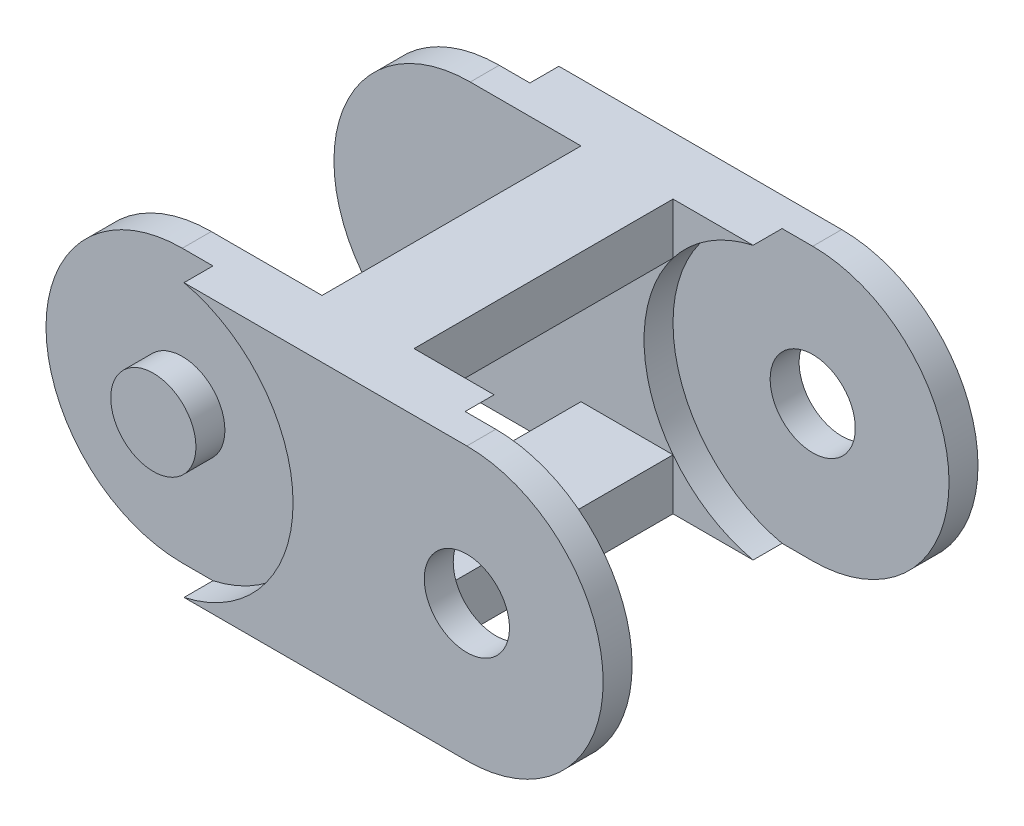
ISO-10303-21;
HEADER;
FILE_DESCRIPTION(('STEP AP214'),'2;1');
FILE_NAME('part.step','',(''),(''),'','','');
FILE_SCHEMA(('AUTOMOTIVE_DESIGN { 1 0 10303 214 1 1 1 1 }'));
ENDSEC;
DATA;
#1=APPLICATION_CONTEXT('core data for automotive mechanical design processes');
#2=APPLICATION_PROTOCOL_DEFINITION('international standard','automotive_design',2000,#1);
#3=PRODUCT_CONTEXT('',#1,'mechanical');
#4=PRODUCT('Part','Part','',(#3));
#5=PRODUCT_RELATED_PRODUCT_CATEGORY('part','',(#4));
#6=PRODUCT_DEFINITION_FORMATION('','',#4);
#7=PRODUCT_DEFINITION_CONTEXT('part definition',#1,'design');
#8=PRODUCT_DEFINITION('design','',#6,#7);
#9=PRODUCT_DEFINITION_SHAPE('','',#8);
#10=(LENGTH_UNIT() NAMED_UNIT(*) SI_UNIT(.MILLI.,.METRE.));
#11=(NAMED_UNIT(*) PLANE_ANGLE_UNIT() SI_UNIT($,.RADIAN.));
#12=(NAMED_UNIT(*) SI_UNIT($,.STERADIAN.) SOLID_ANGLE_UNIT());
#13=UNCERTAINTY_MEASURE_WITH_UNIT(LENGTH_MEASURE(1.E-05),#10,'distance_accuracy_value','');
#14=(GEOMETRIC_REPRESENTATION_CONTEXT(3) GLOBAL_UNCERTAINTY_ASSIGNED_CONTEXT((#13)) GLOBAL_UNIT_ASSIGNED_CONTEXT((#10,
#11,#12)) REPRESENTATION_CONTEXT('',''));
#15=CARTESIAN_POINT('',(0.,0.,0.));
#16=DIRECTION('',(0.,0.,1.));
#17=DIRECTION('',(1.,0.,0.));
#18=AXIS2_PLACEMENT_3D('',#15,#16,#17);
#19=CARTESIAN_POINT('',(-23.,0.,0.));
#20=DIRECTION('',(0.,0.,1.));
#21=DIRECTION('',(1.,0.,0.));
#22=AXIS2_PLACEMENT_3D('',#19,#20,#21);
#23=PLANE('',#22);
#24=DIRECTION('',(-1.,0.,0.));
#25=VECTOR('',#24,1.);
#26=CARTESIAN_POINT('',(6.75192319072807,-12.5,0.));
#27=LINE('',#26,#25);
#28=CARTESIAN_POINT('',(6.75192319072807,-12.5,0.));
#29=VERTEX_POINT('',#28);
#30=CARTESIAN_POINT('',(-6.75192319072807,-12.5,0.));
#31=VERTEX_POINT('',#30);
#32=EDGE_CURVE('E242',#29,#31,#27,.T.);
#33=ORIENTED_EDGE('',*,*,#32,.T.);
#34=DIRECTION('',(0.,-1.,0.));
#35=VECTOR('',#34,1.);
#36=CARTESIAN_POINT('',(-6.75192319072807,-12.5,0.));
#37=LINE('',#36,#35);
#38=CARTESIAN_POINT('',(-6.75192319072807,-20.,0.));
#39=VERTEX_POINT('',#38);
#40=EDGE_CURVE('E216',#31,#39,#37,.T.);
#41=ORIENTED_EDGE('',*,*,#40,.T.);
#42=DIRECTION('',(1.,0.,0.));
#43=VECTOR('',#42,1.);
#44=CARTESIAN_POINT('',(-23.,-20.,0.));
#45=LINE('',#44,#43);
#46=CARTESIAN_POINT('',(-23.,-20.,0.));
#47=VERTEX_POINT('',#46);
#48=EDGE_CURVE('E314',#47,#39,#45,.T.);
#49=ORIENTED_EDGE('',*,*,#48,.F.);
#50=CARTESIAN_POINT('',(-23.,0.,0.));
#51=DIRECTION('',(0.,0.,1.));
#52=DIRECTION('',(1.,0.,0.));
#53=AXIS2_PLACEMENT_3D('',#50,#51,#52);
#54=CIRCLE('',#53,20.);
#55=CARTESIAN_POINT('',(-23.,20.,0.));
#56=VERTEX_POINT('',#55);
#57=EDGE_CURVE('E301',#56,#47,#54,.T.);
#58=ORIENTED_EDGE('',*,*,#57,.F.);
#59=DIRECTION('',(-1.,0.,0.));
#60=VECTOR('',#59,1.);
#61=CARTESIAN_POINT('',(-23.,20.,0.));
#62=LINE('',#61,#60);
#63=CARTESIAN_POINT('',(-6.75192319072807,20.,0.));
#64=VERTEX_POINT('',#63);
#65=EDGE_CURVE('E317',#64,#56,#62,.T.);
#66=ORIENTED_EDGE('',*,*,#65,.F.);
#67=DIRECTION('',(0.,1.,0.));
#68=VECTOR('',#67,1.);
#69=CARTESIAN_POINT('',(-6.75192319072807,12.5,0.));
#70=LINE('',#69,#68);
#71=CARTESIAN_POINT('',(-6.75192319072807,12.5,0.));
#72=VERTEX_POINT('',#71);
#73=EDGE_CURVE('E40',#72,#64,#70,.T.);
#74=ORIENTED_EDGE('',*,*,#73,.F.);
#75=DIRECTION('',(-1.,0.,0.));
#76=VECTOR('',#75,1.);
#77=CARTESIAN_POINT('',(6.75192319072807,12.5,0.));
#78=LINE('',#77,#76);
#79=CARTESIAN_POINT('',(6.75192319072807,12.5,0.));
#80=VERTEX_POINT('',#79);
#81=EDGE_CURVE('E252',#80,#72,#78,.T.);
#82=ORIENTED_EDGE('',*,*,#81,.F.);
#83=CARTESIAN_POINT('',(23.,0.,0.));
#84=DIRECTION('',(0.,0.,1.));
#85=DIRECTION('',(1.,0.,0.));
#86=AXIS2_PLACEMENT_3D('',#83,#84,#85);
#87=CIRCLE('',#86,20.5);
#88=EDGE_CURVE('E332',#80,#29,#87,.T.);
#89=ORIENTED_EDGE('',*,*,#88,.T.);
#90=EDGE_LOOP('',(#33,#41,#49,#58,#66,#74,#82,#89));
#91=FACE_BOUND('',#90,.T.);
#92=ADVANCED_FACE('F36',(#91),#23,.F.);
#93=CARTESIAN_POINT('',(6.75192319072807,-20.,0.));
#94=VERTEX_POINT('',#93);
#95=CARTESIAN_POINT('',(18.5,-20.,0.));
#96=VERTEX_POINT('',#95);
#97=EDGE_CURVE('E313',#94,#96,#45,.T.);
#98=ORIENTED_EDGE('',*,*,#97,.F.);
#99=DIRECTION('',(0.,1.,0.));
#100=VECTOR('',#99,1.);
#101=CARTESIAN_POINT('',(6.75192319072807,-12.5,0.));
#102=LINE('',#101,#100);
#103=EDGE_CURVE('E54',#94,#29,#102,.T.);
#104=ORIENTED_EDGE('',*,*,#103,.T.);
#105=EDGE_CURVE('E333',#29,#96,#87,.T.);
#106=ORIENTED_EDGE('',*,*,#105,.T.);
#107=EDGE_LOOP('',(#98,#104,#106));
#108=FACE_BOUND('',#107,.T.);
#109=ADVANCED_FACE('F495',(#108),#23,.F.);
#110=DIRECTION('',(0.,-1.,0.));
#111=VECTOR('',#110,1.);
#112=CARTESIAN_POINT('',(6.75192319072807,12.5,0.));
#113=LINE('',#112,#111);
#114=CARTESIAN_POINT('',(6.75192319072807,20.,0.));
#115=VERTEX_POINT('',#114);
#116=EDGE_CURVE('E255',#115,#80,#113,.T.);
#117=ORIENTED_EDGE('',*,*,#116,.F.);
#118=CARTESIAN_POINT('',(18.5,20.,0.));
#119=VERTEX_POINT('',#118);
#120=EDGE_CURVE('E305',#119,#115,#62,.T.);
#121=ORIENTED_EDGE('',*,*,#120,.F.);
#122=EDGE_CURVE('E330',#119,#80,#87,.T.);
#123=ORIENTED_EDGE('',*,*,#122,.T.);
#124=EDGE_LOOP('',(#117,#121,#123));
#125=FACE_BOUND('',#124,.T.);
#126=ADVANCED_FACE('F386',(#125),#23,.F.);
#127=CARTESIAN_POINT('',(-23.,0.,8.5));
#128=DIRECTION('',(0.,0.,-1.));
#129=DIRECTION('',(-1.,0.,0.));
#130=AXIS2_PLACEMENT_3D('',#127,#128,#129);
#131=CYLINDRICAL_SURFACE('',#130,20.);
#132=CARTESIAN_POINT('',(-23.,0.,4.25));
#133=DIRECTION('',(0.,0.,1.));
#134=DIRECTION('',(1.,0.,0.));
#135=AXIS2_PLACEMENT_3D('',#132,#133,#134);
#136=CIRCLE('',#135,20.);
#137=CARTESIAN_POINT('',(-23.,20.,4.25));
#138=VERTEX_POINT('',#137);
#139=CARTESIAN_POINT('',(-23.,-20.,4.25));
#140=VERTEX_POINT('',#139);
#141=EDGE_CURVE('E284',#138,#140,#136,.T.);
#142=ORIENTED_EDGE('',*,*,#141,.F.);
#143=DIRECTION('',(0.,0.,-1.));
#144=VECTOR('',#143,1.);
#145=CARTESIAN_POINT('',(-23.,20.,8.5));
#146=LINE('',#145,#144);
#147=EDGE_CURVE('E310',#138,#56,#146,.T.);
#148=ORIENTED_EDGE('',*,*,#147,.T.);
#149=ORIENTED_EDGE('',*,*,#57,.T.);
#150=DIRECTION('',(0.,0.,-1.));
#151=VECTOR('',#150,1.);
#152=CARTESIAN_POINT('',(-23.,-20.,8.5));
#153=LINE('',#152,#151);
#154=EDGE_CURVE('E334',#140,#47,#153,.T.);
#155=ORIENTED_EDGE('',*,*,#154,.F.);
#156=EDGE_LOOP('',(#142,#148,#149,#155));
#157=FACE_BOUND('',#156,.T.);
#158=ADVANCED_FACE('F38',(#157),#131,.T.);
#159=CARTESIAN_POINT('',(23.,0.,8.5));
#160=DIRECTION('',(0.,0.,-1.));
#161=DIRECTION('',(-1.,0.,0.));
#162=AXIS2_PLACEMENT_3D('',#159,#160,#161);
#163=CYLINDRICAL_SURFACE('',#162,20.);
#164=CARTESIAN_POINT('',(23.,0.,4.25));
#165=DIRECTION('',(0.,0.,-1.));
#166=DIRECTION('',(-1.,0.,0.));
#167=AXIS2_PLACEMENT_3D('',#164,#165,#166);
#168=CIRCLE('',#167,20.);
#169=CARTESIAN_POINT('',(23.,20.,4.25));
#170=VERTEX_POINT('',#169);
#171=CARTESIAN_POINT('',(23.,-20.,4.25));
#172=VERTEX_POINT('',#171);
#173=EDGE_CURVE('E297',#170,#172,#168,.T.);
#174=ORIENTED_EDGE('',*,*,#173,.F.);
#175=DIRECTION('',(0.,0.,-1.));
#176=VECTOR('',#175,1.);
#177=CARTESIAN_POINT('',(23.,20.,8.5));
#178=LINE('',#177,#176);
#179=CARTESIAN_POINT('',(23.,20.,8.5));
#180=VERTEX_POINT('',#179);
#181=EDGE_CURVE('E338',#180,#170,#178,.T.);
#182=ORIENTED_EDGE('',*,*,#181,.F.);
#183=CARTESIAN_POINT('',(23.,0.,8.5));
#184=DIRECTION('',(0.,0.,1.));
#185=DIRECTION('',(1.,0.,0.));
#186=AXIS2_PLACEMENT_3D('',#183,#184,#185);
#187=CIRCLE('',#186,20.);
#188=CARTESIAN_POINT('',(23.,-20.,8.5));
#189=VERTEX_POINT('',#188);
#190=EDGE_CURVE('E304',#189,#180,#187,.T.);
#191=ORIENTED_EDGE('',*,*,#190,.F.);
#192=DIRECTION('',(0.,0.,-1.));
#193=VECTOR('',#192,1.);
#194=CARTESIAN_POINT('',(23.,-20.,8.5));
#195=LINE('',#194,#193);
#196=EDGE_CURVE('E336',#189,#172,#195,.T.);
#197=ORIENTED_EDGE('',*,*,#196,.T.);
#198=EDGE_LOOP('',(#174,#182,#191,#197));
#199=FACE_BOUND('',#198,.T.);
#200=ADVANCED_FACE('F370',(#199),#163,.T.);
#201=CARTESIAN_POINT('',(-23.,-20.,8.5));
#202=DIRECTION('',(0.,1.,0.));
#203=DIRECTION('',(-1.,0.,0.));
#204=AXIS2_PLACEMENT_3D('',#201,#202,#203);
#205=PLANE('',#204);
#206=DIRECTION('',(0.,0.,1.));
#207=VECTOR('',#206,1.);
#208=CARTESIAN_POINT('',(6.75192319072807,-20.,-38.));
#209=LINE('',#208,#207);
#210=CARTESIAN_POINT('',(6.75192319072807,-20.,-38.));
#211=VERTEX_POINT('',#210);
#212=EDGE_CURVE('E248',#211,#94,#209,.T.);
#213=ORIENTED_EDGE('',*,*,#212,.T.);
#214=ORIENTED_EDGE('',*,*,#97,.T.);
#215=DIRECTION('',(0.,0.,-1.));
#216=VECTOR('',#215,1.);
#217=CARTESIAN_POINT('',(18.5,-20.,4.25));
#218=LINE('',#217,#216);
#219=CARTESIAN_POINT('',(18.5,-20.,4.25));
#220=VERTEX_POINT('',#219);
#221=EDGE_CURVE('E294',#96,#220,#218,.F.);
#222=ORIENTED_EDGE('',*,*,#221,.T.);
#223=DIRECTION('',(-1.,0.,0.));
#224=VECTOR('',#223,1.);
#225=CARTESIAN_POINT('',(-23.,-20.,4.25));
#226=LINE('',#225,#224);
#227=EDGE_CURVE('E299',#172,#220,#226,.T.);
#228=ORIENTED_EDGE('',*,*,#227,.F.);
#229=ORIENTED_EDGE('',*,*,#196,.F.);
#230=DIRECTION('',(1.,0.,0.));
#231=VECTOR('',#230,1.);
#232=CARTESIAN_POINT('',(-23.,-20.,8.5));
#233=LINE('',#232,#231);
#234=CARTESIAN_POINT('',(-18.5,-20.,8.5));
#235=VERTEX_POINT('',#234);
#236=EDGE_CURVE('E302',#235,#189,#233,.T.);
#237=ORIENTED_EDGE('',*,*,#236,.F.);
#238=DIRECTION('',(0.,0.,1.));
#239=VECTOR('',#238,1.);
#240=CARTESIAN_POINT('',(-18.5,-20.,4.25));
#241=LINE('',#240,#239);
#242=CARTESIAN_POINT('',(-18.5,-20.,4.25));
#243=VERTEX_POINT('',#242);
#244=EDGE_CURVE('E281',#235,#243,#241,.F.);
#245=ORIENTED_EDGE('',*,*,#244,.T.);
#246=DIRECTION('',(1.,0.,0.));
#247=VECTOR('',#246,1.);
#248=CARTESIAN_POINT('',(-23.,-20.,4.25));
#249=LINE('',#248,#247);
#250=EDGE_CURVE('E286',#140,#243,#249,.T.);
#251=ORIENTED_EDGE('',*,*,#250,.F.);
#252=ORIENTED_EDGE('',*,*,#154,.T.);
#253=ORIENTED_EDGE('',*,*,#48,.T.);
#254=DIRECTION('',(0.,0.,1.));
#255=VECTOR('',#254,1.);
#256=CARTESIAN_POINT('',(-6.75192319072807,-20.,-38.));
#257=LINE('',#256,#255);
#258=CARTESIAN_POINT('',(-6.75192319072807,-20.,-38.));
#259=VERTEX_POINT('',#258);
#260=EDGE_CURVE('E246',#259,#39,#257,.T.);
#261=ORIENTED_EDGE('',*,*,#260,.F.);
#262=DIRECTION('',(1.,0.,0.));
#263=VECTOR('',#262,1.);
#264=CARTESIAN_POINT('',(-23.,-20.,-38.));
#265=LINE('',#264,#263);
#266=CARTESIAN_POINT('',(-23.,-20.,-38.));
#267=VERTEX_POINT('',#266);
#268=EDGE_CURVE('E208',#267,#259,#265,.T.);
#269=ORIENTED_EDGE('',*,*,#268,.F.);
#270=DIRECTION('',(0.,0.,1.));
#271=VECTOR('',#270,1.);
#272=CARTESIAN_POINT('',(-23.,-20.,-46.5));
#273=LINE('',#272,#271);
#274=CARTESIAN_POINT('',(-23.,-20.,-42.25));
#275=VERTEX_POINT('',#274);
#276=EDGE_CURVE('E435',#275,#267,#273,.T.);
#277=ORIENTED_EDGE('',*,*,#276,.F.);
#278=DIRECTION('',(1.,0.,0.));
#279=VECTOR('',#278,1.);
#280=CARTESIAN_POINT('',(-23.,-20.,-42.25));
#281=LINE('',#280,#279);
#282=CARTESIAN_POINT('',(-18.5,-20.,-42.25));
#283=VERTEX_POINT('',#282);
#284=EDGE_CURVE('E459',#275,#283,#281,.T.);
#285=ORIENTED_EDGE('',*,*,#284,.T.);
#286=DIRECTION('',(0.,0.,-1.));
#287=VECTOR('',#286,1.);
#288=CARTESIAN_POINT('',(-18.5,-20.,-42.25));
#289=LINE('',#288,#287);
#290=CARTESIAN_POINT('',(-18.5,-20.,-46.5));
#291=VERTEX_POINT('',#290);
#292=EDGE_CURVE('E461',#291,#283,#289,.F.);
#293=ORIENTED_EDGE('',*,*,#292,.F.);
#294=DIRECTION('',(1.,0.,0.));
#295=VECTOR('',#294,1.);
#296=CARTESIAN_POINT('',(-23.,-20.,-46.5));
#297=LINE('',#296,#295);
#298=CARTESIAN_POINT('',(23.,-20.,-46.5));
#299=VERTEX_POINT('',#298);
#300=EDGE_CURVE('E481',#291,#299,#297,.T.);
#301=ORIENTED_EDGE('',*,*,#300,.T.);
#302=DIRECTION('',(0.,0.,1.));
#303=VECTOR('',#302,1.);
#304=CARTESIAN_POINT('',(23.,-20.,-46.5));
#305=LINE('',#304,#303);
#306=CARTESIAN_POINT('',(23.,-20.,-42.25));
#307=VERTEX_POINT('',#306);
#308=EDGE_CURVE('E432',#299,#307,#305,.T.);
#309=ORIENTED_EDGE('',*,*,#308,.T.);
#310=DIRECTION('',(-1.,0.,0.));
#311=VECTOR('',#310,1.);
#312=CARTESIAN_POINT('',(-23.,-20.,-42.25));
#313=LINE('',#312,#311);
#314=CARTESIAN_POINT('',(18.5,-20.,-42.25));
#315=VERTEX_POINT('',#314);
#316=EDGE_CURVE('E478',#307,#315,#313,.T.);
#317=ORIENTED_EDGE('',*,*,#316,.T.);
#318=DIRECTION('',(0.,0.,1.));
#319=VECTOR('',#318,1.);
#320=CARTESIAN_POINT('',(18.5,-20.,-42.25));
#321=LINE('',#320,#319);
#322=CARTESIAN_POINT('',(18.5,-20.,-38.));
#323=VERTEX_POINT('',#322);
#324=EDGE_CURVE('E472',#323,#315,#321,.F.);
#325=ORIENTED_EDGE('',*,*,#324,.F.);
#326=EDGE_CURVE('E486',#211,#323,#265,.T.);
#327=ORIENTED_EDGE('',*,*,#326,.F.);
#328=EDGE_LOOP('',(#213,#214,#222,#228,#229,#237,#245,#251,#252,#253,#261,#269,#277,#285,#293,
#301,#309,#317,#325,#327));
#329=FACE_BOUND('',#328,.T.);
#330=ADVANCED_FACE('F354',(#329),#205,.F.);
#331=CARTESIAN_POINT('',(-23.,20.,8.5));
#332=DIRECTION('',(0.,-1.,0.));
#333=DIRECTION('',(1.,0.,0.));
#334=AXIS2_PLACEMENT_3D('',#331,#332,#333);
#335=PLANE('',#334);
#336=DIRECTION('',(0.,0.,1.));
#337=VECTOR('',#336,1.);
#338=CARTESIAN_POINT('',(-6.75192319072807,20.,-38.));
#339=LINE('',#338,#337);
#340=CARTESIAN_POINT('',(-6.75192319072807,20.,-38.));
#341=VERTEX_POINT('',#340);
#342=EDGE_CURVE('E266',#341,#64,#339,.T.);
#343=ORIENTED_EDGE('',*,*,#342,.T.);
#344=ORIENTED_EDGE('',*,*,#65,.T.);
#345=ORIENTED_EDGE('',*,*,#147,.F.);
#346=DIRECTION('',(-1.,0.,0.));
#347=VECTOR('',#346,1.);
#348=CARTESIAN_POINT('',(-23.,20.,4.25));
#349=LINE('',#348,#347);
#350=CARTESIAN_POINT('',(-18.5,20.,4.25));
#351=VERTEX_POINT('',#350);
#352=EDGE_CURVE('E11',#351,#138,#349,.T.);
#353=ORIENTED_EDGE('',*,*,#352,.F.);
#354=DIRECTION('',(0.,0.,1.));
#355=VECTOR('',#354,1.);
#356=CARTESIAN_POINT('',(-18.5,20.,4.25));
#357=LINE('',#356,#355);
#358=CARTESIAN_POINT('',(-18.5,20.,8.5));
#359=VERTEX_POINT('',#358);
#360=EDGE_CURVE('E278',#351,#359,#357,.T.);
#361=ORIENTED_EDGE('',*,*,#360,.T.);
#362=DIRECTION('',(-1.,0.,0.));
#363=VECTOR('',#362,1.);
#364=CARTESIAN_POINT('',(-23.,20.,8.5));
#365=LINE('',#364,#363);
#366=EDGE_CURVE('E307',#180,#359,#365,.T.);
#367=ORIENTED_EDGE('',*,*,#366,.F.);
#368=ORIENTED_EDGE('',*,*,#181,.T.);
#369=DIRECTION('',(1.,0.,0.));
#370=VECTOR('',#369,1.);
#371=CARTESIAN_POINT('',(-23.,20.,4.25));
#372=LINE('',#371,#370);
#373=CARTESIAN_POINT('',(18.5,20.,4.25));
#374=VERTEX_POINT('',#373);
#375=EDGE_CURVE('E328',#374,#170,#372,.T.);
#376=ORIENTED_EDGE('',*,*,#375,.F.);
#377=DIRECTION('',(0.,0.,-1.));
#378=VECTOR('',#377,1.);
#379=CARTESIAN_POINT('',(18.5,20.,4.25));
#380=LINE('',#379,#378);
#381=EDGE_CURVE('E291',#374,#119,#380,.T.);
#382=ORIENTED_EDGE('',*,*,#381,.T.);
#383=ORIENTED_EDGE('',*,*,#120,.T.);
#384=DIRECTION('',(0.,0.,1.));
#385=VECTOR('',#384,1.);
#386=CARTESIAN_POINT('',(6.75192319072807,20.,-38.));
#387=LINE('',#386,#385);
#388=CARTESIAN_POINT('',(6.75192319072807,20.,-38.));
#389=VERTEX_POINT('',#388);
#390=EDGE_CURVE('E261',#389,#115,#387,.T.);
#391=ORIENTED_EDGE('',*,*,#390,.F.);
#392=DIRECTION('',(-1.,0.,0.));
#393=VECTOR('',#392,1.);
#394=CARTESIAN_POINT('',(-23.,20.,-38.));
#395=LINE('',#394,#393);
#396=CARTESIAN_POINT('',(18.5,20.,-38.));
#397=VERTEX_POINT('',#396);
#398=EDGE_CURVE('E419',#397,#389,#395,.T.);
#399=ORIENTED_EDGE('',*,*,#398,.F.);
#400=DIRECTION('',(0.,0.,1.));
#401=VECTOR('',#400,1.);
#402=CARTESIAN_POINT('',(18.5,20.,-42.25));
#403=LINE('',#402,#401);
#404=CARTESIAN_POINT('',(18.5,20.,-42.25));
#405=VERTEX_POINT('',#404);
#406=EDGE_CURVE('E470',#405,#397,#403,.T.);
#407=ORIENTED_EDGE('',*,*,#406,.F.);
#408=DIRECTION('',(1.,0.,0.));
#409=VECTOR('',#408,1.);
#410=CARTESIAN_POINT('',(-23.,20.,-42.25));
#411=LINE('',#410,#409);
#412=CARTESIAN_POINT('',(23.,20.,-42.25));
#413=VERTEX_POINT('',#412);
#414=EDGE_CURVE('E440',#405,#413,#411,.T.);
#415=ORIENTED_EDGE('',*,*,#414,.T.);
#416=DIRECTION('',(0.,0.,1.));
#417=VECTOR('',#416,1.);
#418=CARTESIAN_POINT('',(23.,20.,-46.5));
#419=LINE('',#418,#417);
#420=CARTESIAN_POINT('',(23.,20.,-46.5));
#421=VERTEX_POINT('',#420);
#422=EDGE_CURVE('E428',#421,#413,#419,.T.);
#423=ORIENTED_EDGE('',*,*,#422,.F.);
#424=DIRECTION('',(-1.,0.,0.));
#425=VECTOR('',#424,1.);
#426=CARTESIAN_POINT('',(-23.,20.,-46.5));
#427=LINE('',#426,#425);
#428=CARTESIAN_POINT('',(-18.5,20.,-46.5));
#429=VERTEX_POINT('',#428);
#430=EDGE_CURVE('E429',#421,#429,#427,.T.);
#431=ORIENTED_EDGE('',*,*,#430,.T.);
#432=DIRECTION('',(0.,0.,-1.));
#433=VECTOR('',#432,1.);
#434=CARTESIAN_POINT('',(-18.5,20.,-42.25));
#435=LINE('',#434,#433);
#436=CARTESIAN_POINT('',(-18.5,20.,-42.25));
#437=VERTEX_POINT('',#436);
#438=EDGE_CURVE('E449',#437,#429,#435,.T.);
#439=ORIENTED_EDGE('',*,*,#438,.F.);
#440=DIRECTION('',(-1.,0.,0.));
#441=VECTOR('',#440,1.);
#442=CARTESIAN_POINT('',(-23.,20.,-42.25));
#443=LINE('',#442,#441);
#444=CARTESIAN_POINT('',(-23.,20.,-42.25));
#445=VERTEX_POINT('',#444);
#446=EDGE_CURVE('E243',#437,#445,#443,.T.);
#447=ORIENTED_EDGE('',*,*,#446,.T.);
#448=DIRECTION('',(0.,0.,1.));
#449=VECTOR('',#448,1.);
#450=CARTESIAN_POINT('',(-23.,20.,-46.5));
#451=LINE('',#450,#449);
#452=CARTESIAN_POINT('',(-23.,20.,-38.));
#453=VERTEX_POINT('',#452);
#454=EDGE_CURVE('E425',#445,#453,#451,.T.);
#455=ORIENTED_EDGE('',*,*,#454,.T.);
#456=EDGE_CURVE('E398',#341,#453,#395,.T.);
#457=ORIENTED_EDGE('',*,*,#456,.F.);
#458=EDGE_LOOP('',(#343,#344,#345,#353,#361,#367,#368,#376,#382,#383,#391,#399,#407,#415,#423,
#431,#439,#447,#455,#457));
#459=FACE_BOUND('',#458,.T.);
#460=ADVANCED_FACE('F363',(#459),#335,.F.);
#461=CARTESIAN_POINT('',(-23.,0.,8.5));
#462=DIRECTION('',(0.,0.,1.));
#463=DIRECTION('',(1.,0.,0.));
#464=AXIS2_PLACEMENT_3D('',#461,#462,#463);
#465=PLANE('',#464);
#466=CARTESIAN_POINT('',(23.,0.,8.5));
#467=DIRECTION('',(0.,0.,-1.));
#468=DIRECTION('',(-1.,0.,0.));
#469=AXIS2_PLACEMENT_3D('',#466,#467,#468);
#470=CIRCLE('',#469,6.25);
#471=CARTESIAN_POINT('',(16.75,0.,8.5));
#472=VERTEX_POINT('',#471);
#473=EDGE_CURVE('E270',#472,#472,#470,.T.);
#474=ORIENTED_EDGE('',*,*,#473,.T.);
#475=EDGE_LOOP('',(#474));
#476=FACE_BOUND('',#475,.T.);
#477=CARTESIAN_POINT('',(-23.,0.,8.5));
#478=DIRECTION('',(0.,0.,1.));
#479=DIRECTION('',(1.,0.,0.));
#480=AXIS2_PLACEMENT_3D('',#477,#478,#479);
#481=CIRCLE('',#480,20.5);
#482=EDGE_CURVE('E46',#235,#359,#481,.T.);
#483=ORIENTED_EDGE('',*,*,#482,.F.);
#484=ORIENTED_EDGE('',*,*,#236,.T.);
#485=ORIENTED_EDGE('',*,*,#190,.T.);
#486=ORIENTED_EDGE('',*,*,#366,.T.);
#487=EDGE_LOOP('',(#483,#484,#485,#486));
#488=FACE_BOUND('',#487,.T.);
#489=ADVANCED_FACE('F365',(#476,#488),#465,.T.);
#490=CARTESIAN_POINT('',(23.,0.,4.25));
#491=DIRECTION('',(0.,0.,-1.));
#492=DIRECTION('',(-1.,0.,0.));
#493=AXIS2_PLACEMENT_3D('',#490,#491,#492);
#494=PLANE('',#493);
#495=CARTESIAN_POINT('',(23.,0.,4.25));
#496=DIRECTION('',(0.,0.,-1.));
#497=DIRECTION('',(-1.,0.,0.));
#498=AXIS2_PLACEMENT_3D('',#495,#496,#497);
#499=CIRCLE('',#498,6.25);
#500=CARTESIAN_POINT('',(16.75,0.,4.25));
#501=VERTEX_POINT('',#500);
#502=EDGE_CURVE('E269',#501,#501,#499,.T.);
#503=ORIENTED_EDGE('',*,*,#502,.F.);
#504=EDGE_LOOP('',(#503));
#505=FACE_BOUND('',#504,.T.);
#506=ORIENTED_EDGE('',*,*,#227,.T.);
#507=CARTESIAN_POINT('',(23.,0.,4.25));
#508=DIRECTION('',(0.,0.,-1.));
#509=DIRECTION('',(-1.,0.,0.));
#510=AXIS2_PLACEMENT_3D('',#507,#508,#509);
#511=CIRCLE('',#510,20.5);
#512=EDGE_CURVE('E288',#220,#374,#511,.T.);
#513=ORIENTED_EDGE('',*,*,#512,.T.);
#514=ORIENTED_EDGE('',*,*,#375,.T.);
#515=ORIENTED_EDGE('',*,*,#173,.T.);
#516=EDGE_LOOP('',(#506,#513,#514,#515));
#517=FACE_BOUND('',#516,.T.);
#518=ADVANCED_FACE('F373',(#505,#517),#494,.T.);
#519=CARTESIAN_POINT('',(23.,0.,4.25));
#520=DIRECTION('',(0.,0.,-1.));
#521=DIRECTION('',(-1.,0.,0.));
#522=AXIS2_PLACEMENT_3D('',#519,#520,#521);
#523=CYLINDRICAL_SURFACE('',#522,20.5);
#524=ORIENTED_EDGE('',*,*,#122,.F.);
#525=ORIENTED_EDGE('',*,*,#381,.F.);
#526=ORIENTED_EDGE('',*,*,#512,.F.);
#527=ORIENTED_EDGE('',*,*,#221,.F.);
#528=ORIENTED_EDGE('',*,*,#105,.F.);
#529=ORIENTED_EDGE('',*,*,#88,.F.);
#530=EDGE_LOOP('',(#524,#525,#526,#527,#528,#529));
#531=FACE_BOUND('',#530,.T.);
#532=ADVANCED_FACE('F380',(#531),#523,.F.);
#533=CARTESIAN_POINT('',(-23.,0.,4.25));
#534=DIRECTION('',(0.,0.,1.));
#535=DIRECTION('',(1.,0.,0.));
#536=AXIS2_PLACEMENT_3D('',#533,#534,#535);
#537=PLANE('',#536);
#538=CARTESIAN_POINT('',(-23.,0.,4.25));
#539=DIRECTION('',(0.,0.,1.));
#540=DIRECTION('',(1.,0.,0.));
#541=AXIS2_PLACEMENT_3D('',#538,#539,#540);
#542=CIRCLE('',#541,6.25);
#543=CARTESIAN_POINT('',(-16.75,0.,4.25));
#544=VERTEX_POINT('',#543);
#545=EDGE_CURVE('E262',#544,#544,#542,.T.);
#546=ORIENTED_EDGE('',*,*,#545,.F.);
#547=EDGE_LOOP('',(#546));
#548=FACE_BOUND('',#547,.T.);
#549=ORIENTED_EDGE('',*,*,#250,.T.);
#550=CARTESIAN_POINT('',(-23.,0.,4.25));
#551=DIRECTION('',(0.,0.,1.));
#552=DIRECTION('',(1.,0.,0.));
#553=AXIS2_PLACEMENT_3D('',#550,#551,#552);
#554=CIRCLE('',#553,20.5);
#555=EDGE_CURVE('E273',#243,#351,#554,.T.);
#556=ORIENTED_EDGE('',*,*,#555,.T.);
#557=ORIENTED_EDGE('',*,*,#352,.T.);
#558=ORIENTED_EDGE('',*,*,#141,.T.);
#559=EDGE_LOOP('',(#549,#556,#557,#558));
#560=FACE_BOUND('',#559,.T.);
#561=ADVANCED_FACE('F359',(#548,#560),#537,.T.);
#562=CARTESIAN_POINT('',(-23.,0.,4.25));
#563=DIRECTION('',(0.,0.,1.));
#564=DIRECTION('',(1.,0.,0.));
#565=AXIS2_PLACEMENT_3D('',#562,#563,#564);
#566=CYLINDRICAL_SURFACE('',#565,20.5);
#567=ORIENTED_EDGE('',*,*,#482,.T.);
#568=ORIENTED_EDGE('',*,*,#360,.F.);
#569=ORIENTED_EDGE('',*,*,#555,.F.);
#570=ORIENTED_EDGE('',*,*,#244,.F.);
#571=EDGE_LOOP('',(#567,#568,#569,#570));
#572=FACE_BOUND('',#571,.T.);
#573=ADVANCED_FACE('F361',(#572),#566,.F.);
#574=CARTESIAN_POINT('',(23.,0.,8.5));
#575=DIRECTION('',(0.,0.,-1.));
#576=DIRECTION('',(-1.,0.,0.));
#577=AXIS2_PLACEMENT_3D('',#574,#575,#576);
#578=CYLINDRICAL_SURFACE('',#577,6.25);
#579=ORIENTED_EDGE('',*,*,#473,.F.);
#580=EDGE_LOOP('',(#579));
#581=FACE_BOUND('',#580,.T.);
#582=ORIENTED_EDGE('',*,*,#502,.T.);
#583=EDGE_LOOP('',(#582));
#584=FACE_BOUND('',#583,.T.);
#585=ADVANCED_FACE('F557',(#581,#584),#578,.F.);
#586=CARTESIAN_POINT('',(-23.,0.,26.1776695296637));
#587=DIRECTION('',(0.,0.,-1.));
#588=DIRECTION('',(-1.,0.,0.));
#589=AXIS2_PLACEMENT_3D('',#586,#587,#588);
#590=CYLINDRICAL_SURFACE('',#589,6.25);
#591=ORIENTED_EDGE('',*,*,#545,.T.);
#592=EDGE_LOOP('',(#591));
#593=FACE_BOUND('',#592,.T.);
#594=CARTESIAN_POINT('',(-23.,0.,8.5));
#595=DIRECTION('',(0.,0.,1.));
#596=DIRECTION('',(1.,0.,0.));
#597=AXIS2_PLACEMENT_3D('',#594,#595,#596);
#598=CIRCLE('',#597,6.25);
#599=CARTESIAN_POINT('',(-16.75,0.,8.5));
#600=VERTEX_POINT('',#599);
#601=EDGE_CURVE('E265',#600,#600,#598,.T.);
#602=ORIENTED_EDGE('',*,*,#601,.F.);
#603=EDGE_LOOP('',(#602));
#604=FACE_BOUND('',#603,.T.);
#605=ADVANCED_FACE('F565',(#593,#604),#590,.T.);
#606=CARTESIAN_POINT('',(-23.,0.,8.5));
#607=DIRECTION('',(0.,0.,1.));
#608=DIRECTION('',(1.,0.,0.));
#609=AXIS2_PLACEMENT_3D('',#606,#607,#608);
#610=PLANE('',#609);
#611=ORIENTED_EDGE('',*,*,#601,.T.);
#612=EDGE_LOOP('',(#611));
#613=FACE_BOUND('',#612,.T.);
#614=ADVANCED_FACE('F574',(#613),#610,.T.);
#615=CARTESIAN_POINT('',(-6.75192319072807,12.5,-38.));
#616=DIRECTION('',(1.,0.,0.));
#617=DIRECTION('',(0.,0.,-1.));
#618=AXIS2_PLACEMENT_3D('',#615,#616,#617);
#619=PLANE('',#618);
#620=ORIENTED_EDGE('',*,*,#73,.T.);
#621=ORIENTED_EDGE('',*,*,#342,.F.);
#622=DIRECTION('',(0.,1.,0.));
#623=VECTOR('',#622,1.);
#624=CARTESIAN_POINT('',(-6.75192319072807,12.5,-38.));
#625=LINE('',#624,#623);
#626=CARTESIAN_POINT('',(-6.75192319072807,12.5,-38.));
#627=VERTEX_POINT('',#626);
#628=EDGE_CURVE('E227',#627,#341,#625,.T.);
#629=ORIENTED_EDGE('',*,*,#628,.F.);
#630=DIRECTION('',(0.,0.,1.));
#631=VECTOR('',#630,1.);
#632=CARTESIAN_POINT('',(-6.75192319072807,12.5,-38.));
#633=LINE('',#632,#631);
#634=EDGE_CURVE('E254',#627,#72,#633,.T.);
#635=ORIENTED_EDGE('',*,*,#634,.T.);
#636=EDGE_LOOP('',(#620,#621,#629,#635));
#637=FACE_BOUND('',#636,.T.);
#638=ADVANCED_FACE('F400',(#637),#619,.F.);
#639=CARTESIAN_POINT('',(6.75192319072807,12.5,-38.));
#640=DIRECTION('',(-1.,0.,0.));
#641=DIRECTION('',(0.,0.,1.));
#642=AXIS2_PLACEMENT_3D('',#639,#640,#641);
#643=PLANE('',#642);
#644=ORIENTED_EDGE('',*,*,#116,.T.);
#645=DIRECTION('',(0.,0.,1.));
#646=VECTOR('',#645,1.);
#647=CARTESIAN_POINT('',(6.75192319072807,12.5,-38.));
#648=LINE('',#647,#646);
#649=CARTESIAN_POINT('',(6.75192319072807,12.5,-38.));
#650=VERTEX_POINT('',#649);
#651=EDGE_CURVE('E258',#650,#80,#648,.T.);
#652=ORIENTED_EDGE('',*,*,#651,.F.);
#653=DIRECTION('',(0.,-1.,0.));
#654=VECTOR('',#653,1.);
#655=CARTESIAN_POINT('',(6.75192319072807,12.5,-38.));
#656=LINE('',#655,#654);
#657=EDGE_CURVE('E238',#389,#650,#656,.T.);
#658=ORIENTED_EDGE('',*,*,#657,.F.);
#659=ORIENTED_EDGE('',*,*,#390,.T.);
#660=EDGE_LOOP('',(#644,#652,#658,#659));
#661=FACE_BOUND('',#660,.T.);
#662=ADVANCED_FACE('F591',(#661),#643,.F.);
#663=CARTESIAN_POINT('',(6.75192319072807,12.5,-38.));
#664=DIRECTION('',(0.,1.,0.));
#665=DIRECTION('',(0.,0.,1.));
#666=AXIS2_PLACEMENT_3D('',#663,#664,#665);
#667=PLANE('',#666);
#668=ORIENTED_EDGE('',*,*,#81,.T.);
#669=ORIENTED_EDGE('',*,*,#634,.F.);
#670=DIRECTION('',(-1.,0.,0.));
#671=VECTOR('',#670,1.);
#672=CARTESIAN_POINT('',(6.75192319072807,12.5,-38.));
#673=LINE('',#672,#671);
#674=EDGE_CURVE('E232',#650,#627,#673,.T.);
#675=ORIENTED_EDGE('',*,*,#674,.F.);
#676=ORIENTED_EDGE('',*,*,#651,.T.);
#677=EDGE_LOOP('',(#668,#669,#675,#676));
#678=FACE_BOUND('',#677,.T.);
#679=ADVANCED_FACE('F405',(#678),#667,.F.);
#680=CARTESIAN_POINT('',(-6.75192319072807,-12.5,-38.));
#681=DIRECTION('',(-1.,0.,0.));
#682=DIRECTION('',(0.,0.,1.));
#683=AXIS2_PLACEMENT_3D('',#680,#681,#682);
#684=PLANE('',#683);
#685=ORIENTED_EDGE('',*,*,#40,.F.);
#686=DIRECTION('',(0.,0.,1.));
#687=VECTOR('',#686,1.);
#688=CARTESIAN_POINT('',(-6.75192319072807,-12.5,-38.));
#689=LINE('',#688,#687);
#690=CARTESIAN_POINT('',(-6.75192319072807,-12.5,-38.));
#691=VERTEX_POINT('',#690);
#692=EDGE_CURVE('E213',#691,#31,#689,.T.);
#693=ORIENTED_EDGE('',*,*,#692,.F.);
#694=DIRECTION('',(0.,-1.,0.));
#695=VECTOR('',#694,1.);
#696=CARTESIAN_POINT('',(-6.75192319072807,-12.5,-38.));
#697=LINE('',#696,#695);
#698=EDGE_CURVE('E199',#691,#259,#697,.T.);
#699=ORIENTED_EDGE('',*,*,#698,.T.);
#700=ORIENTED_EDGE('',*,*,#260,.T.);
#701=EDGE_LOOP('',(#685,#693,#699,#700));
#702=FACE_BOUND('',#701,.T.);
#703=ADVANCED_FACE('F214',(#702),#684,.T.);
#704=CARTESIAN_POINT('',(6.75192319072807,-12.5,-38.));
#705=DIRECTION('',(0.,1.,0.));
#706=DIRECTION('',(0.,0.,1.));
#707=AXIS2_PLACEMENT_3D('',#704,#705,#706);
#708=PLANE('',#707);
#709=ORIENTED_EDGE('',*,*,#32,.F.);
#710=DIRECTION('',(0.,0.,1.));
#711=VECTOR('',#710,1.);
#712=CARTESIAN_POINT('',(6.75192319072807,-12.5,-38.));
#713=LINE('',#712,#711);
#714=CARTESIAN_POINT('',(6.75192319072807,-12.5,-38.));
#715=VERTEX_POINT('',#714);
#716=EDGE_CURVE('E220',#715,#29,#713,.T.);
#717=ORIENTED_EDGE('',*,*,#716,.F.);
#718=DIRECTION('',(-1.,0.,0.));
#719=VECTOR('',#718,1.);
#720=CARTESIAN_POINT('',(6.75192319072807,-12.5,-38.));
#721=LINE('',#720,#719);
#722=EDGE_CURVE('E204',#715,#691,#721,.T.);
#723=ORIENTED_EDGE('',*,*,#722,.T.);
#724=ORIENTED_EDGE('',*,*,#692,.T.);
#725=EDGE_LOOP('',(#709,#717,#723,#724));
#726=FACE_BOUND('',#725,.T.);
#727=ADVANCED_FACE('F223',(#726),#708,.T.);
#728=CARTESIAN_POINT('',(6.75192319072807,-12.5,-38.));
#729=DIRECTION('',(1.,0.,0.));
#730=DIRECTION('',(0.,0.,-1.));
#731=AXIS2_PLACEMENT_3D('',#728,#729,#730);
#732=PLANE('',#731);
#733=ORIENTED_EDGE('',*,*,#103,.F.);
#734=ORIENTED_EDGE('',*,*,#212,.F.);
#735=DIRECTION('',(0.,1.,0.));
#736=VECTOR('',#735,1.);
#737=CARTESIAN_POINT('',(6.75192319072807,-12.5,-38.));
#738=LINE('',#737,#736);
#739=EDGE_CURVE('E225',#211,#715,#738,.T.);
#740=ORIENTED_EDGE('',*,*,#739,.T.);
#741=ORIENTED_EDGE('',*,*,#716,.T.);
#742=EDGE_LOOP('',(#733,#734,#740,#741));
#743=FACE_BOUND('',#742,.T.);
#744=ADVANCED_FACE('F493',(#743),#732,.T.);
#745=CARTESIAN_POINT('',(-23.,0.,-38.));
#746=DIRECTION('',(0.,0.,-1.));
#747=DIRECTION('',(1.,0.,0.));
#748=AXIS2_PLACEMENT_3D('',#745,#746,#747);
#749=PLANE('',#748);
#750=ORIENTED_EDGE('',*,*,#722,.F.);
#751=CARTESIAN_POINT('',(23.,0.,-38.));
#752=DIRECTION('',(0.,0.,1.));
#753=DIRECTION('',(1.,0.,0.));
#754=AXIS2_PLACEMENT_3D('',#751,#752,#753);
#755=CIRCLE('',#754,20.5);
#756=EDGE_CURVE('E407',#650,#715,#755,.T.);
#757=ORIENTED_EDGE('',*,*,#756,.F.);
#758=ORIENTED_EDGE('',*,*,#674,.T.);
#759=ORIENTED_EDGE('',*,*,#628,.T.);
#760=ORIENTED_EDGE('',*,*,#456,.T.);
#761=CARTESIAN_POINT('',(-23.,0.,-38.));
#762=DIRECTION('',(0.,0.,1.));
#763=DIRECTION('',(1.,0.,0.));
#764=AXIS2_PLACEMENT_3D('',#761,#762,#763);
#765=CIRCLE('',#764,20.);
#766=EDGE_CURVE('E456',#453,#267,#765,.T.);
#767=ORIENTED_EDGE('',*,*,#766,.T.);
#768=ORIENTED_EDGE('',*,*,#268,.T.);
#769=ORIENTED_EDGE('',*,*,#698,.F.);
#770=EDGE_LOOP('',(#750,#757,#758,#759,#760,#767,#768,#769));
#771=FACE_BOUND('',#770,.T.);
#772=ADVANCED_FACE('F201',(#771),#749,.F.);
#773=ORIENTED_EDGE('',*,*,#326,.T.);
#774=EDGE_CURVE('E437',#715,#323,#755,.T.);
#775=ORIENTED_EDGE('',*,*,#774,.F.);
#776=ORIENTED_EDGE('',*,*,#739,.F.);
#777=EDGE_LOOP('',(#773,#775,#776));
#778=FACE_BOUND('',#777,.T.);
#779=ADVANCED_FACE('F491',(#778),#749,.F.);
#780=ORIENTED_EDGE('',*,*,#657,.T.);
#781=EDGE_CURVE('E438',#397,#650,#755,.T.);
#782=ORIENTED_EDGE('',*,*,#781,.F.);
#783=ORIENTED_EDGE('',*,*,#398,.T.);
#784=EDGE_LOOP('',(#780,#782,#783));
#785=FACE_BOUND('',#784,.T.);
#786=ADVANCED_FACE('F627',(#785),#749,.F.);
#787=CARTESIAN_POINT('',(-23.,0.,-46.5));
#788=DIRECTION('',(0.,0.,1.));
#789=DIRECTION('',(-1.,0.,0.));
#790=AXIS2_PLACEMENT_3D('',#787,#788,#789);
#791=CYLINDRICAL_SURFACE('',#790,20.);
#792=CARTESIAN_POINT('',(-23.,0.,-42.25));
#793=DIRECTION('',(0.,0.,1.));
#794=DIRECTION('',(1.,0.,0.));
#795=AXIS2_PLACEMENT_3D('',#792,#793,#794);
#796=CIRCLE('',#795,20.);
#797=EDGE_CURVE('E455',#445,#275,#796,.T.);
#798=ORIENTED_EDGE('',*,*,#797,.T.);
#799=ORIENTED_EDGE('',*,*,#276,.T.);
#800=ORIENTED_EDGE('',*,*,#766,.F.);
#801=ORIENTED_EDGE('',*,*,#454,.F.);
#802=EDGE_LOOP('',(#798,#799,#800,#801));
#803=FACE_BOUND('',#802,.T.);
#804=ADVANCED_FACE('F454',(#803),#791,.T.);
#805=CARTESIAN_POINT('',(23.,0.,-46.5));
#806=DIRECTION('',(0.,0.,1.));
#807=DIRECTION('',(-1.,0.,0.));
#808=AXIS2_PLACEMENT_3D('',#805,#806,#807);
#809=CYLINDRICAL_SURFACE('',#808,20.);
#810=CARTESIAN_POINT('',(23.,0.,-42.25));
#811=DIRECTION('',(0.,0.,-1.));
#812=DIRECTION('',(-1.,0.,0.));
#813=AXIS2_PLACEMENT_3D('',#810,#811,#812);
#814=CIRCLE('',#813,20.);
#815=EDGE_CURVE('E475',#413,#307,#814,.T.);
#816=ORIENTED_EDGE('',*,*,#815,.T.);
#817=ORIENTED_EDGE('',*,*,#308,.F.);
#818=CARTESIAN_POINT('',(23.,0.,-46.5));
#819=DIRECTION('',(0.,0.,1.));
#820=DIRECTION('',(1.,0.,0.));
#821=AXIS2_PLACEMENT_3D('',#818,#819,#820);
#822=CIRCLE('',#821,20.);
#823=EDGE_CURVE('E483',#299,#421,#822,.T.);
#824=ORIENTED_EDGE('',*,*,#823,.T.);
#825=ORIENTED_EDGE('',*,*,#422,.T.);
#826=EDGE_LOOP('',(#816,#817,#824,#825));
#827=FACE_BOUND('',#826,.T.);
#828=ADVANCED_FACE('F646',(#827),#809,.T.);
#829=CARTESIAN_POINT('',(-23.,0.,-46.5));
#830=DIRECTION('',(0.,0.,-1.));
#831=DIRECTION('',(1.,0.,0.));
#832=AXIS2_PLACEMENT_3D('',#829,#830,#831);
#833=PLANE('',#832);
#834=CARTESIAN_POINT('',(23.,0.,-46.5));
#835=DIRECTION('',(0.,0.,-1.));
#836=DIRECTION('',(-1.,0.,0.));
#837=AXIS2_PLACEMENT_3D('',#834,#835,#836);
#838=CIRCLE('',#837,6.25);
#839=CARTESIAN_POINT('',(16.75,0.,-46.5));
#840=VERTEX_POINT('',#839);
#841=EDGE_CURVE('E849',#840,#840,#838,.T.);
#842=ORIENTED_EDGE('',*,*,#841,.F.);
#843=EDGE_LOOP('',(#842));
#844=FACE_BOUND('',#843,.T.);
#845=CARTESIAN_POINT('',(-23.,0.,-46.5));
#846=DIRECTION('',(0.,0.,1.));
#847=DIRECTION('',(1.,0.,0.));
#848=AXIS2_PLACEMENT_3D('',#845,#846,#847);
#849=CIRCLE('',#848,20.5);
#850=EDGE_CURVE('E442',#291,#429,#849,.T.);
#851=ORIENTED_EDGE('',*,*,#850,.T.);
#852=ORIENTED_EDGE('',*,*,#430,.F.);
#853=ORIENTED_EDGE('',*,*,#823,.F.);
#854=ORIENTED_EDGE('',*,*,#300,.F.);
#855=EDGE_LOOP('',(#851,#852,#853,#854));
#856=FACE_BOUND('',#855,.T.);
#857=ADVANCED_FACE('F654',(#844,#856),#833,.T.);
#858=CARTESIAN_POINT('',(23.,0.,-42.25));
#859=DIRECTION('',(0.,0.,1.));
#860=DIRECTION('',(-1.,0.,0.));
#861=AXIS2_PLACEMENT_3D('',#858,#859,#860);
#862=PLANE('',#861);
#863=CARTESIAN_POINT('',(23.,0.,-42.25));
#864=DIRECTION('',(0.,0.,-1.));
#865=DIRECTION('',(-1.,0.,0.));
#866=AXIS2_PLACEMENT_3D('',#863,#864,#865);
#867=CIRCLE('',#866,6.25);
#868=CARTESIAN_POINT('',(16.75,0.,-42.25));
#869=VERTEX_POINT('',#868);
#870=EDGE_CURVE('E846',#869,#869,#867,.T.);
#871=ORIENTED_EDGE('',*,*,#870,.T.);
#872=EDGE_LOOP('',(#871));
#873=FACE_BOUND('',#872,.T.);
#874=ORIENTED_EDGE('',*,*,#316,.F.);
#875=ORIENTED_EDGE('',*,*,#815,.F.);
#876=ORIENTED_EDGE('',*,*,#414,.F.);
#877=CARTESIAN_POINT('',(23.,0.,-42.25));
#878=DIRECTION('',(0.,0.,-1.));
#879=DIRECTION('',(-1.,0.,0.));
#880=AXIS2_PLACEMENT_3D('',#877,#878,#879);
#881=CIRCLE('',#880,20.5);
#882=EDGE_CURVE('E463',#315,#405,#881,.T.);
#883=ORIENTED_EDGE('',*,*,#882,.F.);
#884=EDGE_LOOP('',(#874,#875,#876,#883));
#885=FACE_BOUND('',#884,.T.);
#886=ADVANCED_FACE('F662',(#873,#885),#862,.T.);
#887=CARTESIAN_POINT('',(23.,0.,-42.25));
#888=DIRECTION('',(0.,0.,1.));
#889=DIRECTION('',(-1.,0.,0.));
#890=AXIS2_PLACEMENT_3D('',#887,#888,#889);
#891=CYLINDRICAL_SURFACE('',#890,20.5);
#892=ORIENTED_EDGE('',*,*,#781,.T.);
#893=ORIENTED_EDGE('',*,*,#756,.T.);
#894=ORIENTED_EDGE('',*,*,#774,.T.);
#895=ORIENTED_EDGE('',*,*,#324,.T.);
#896=ORIENTED_EDGE('',*,*,#882,.T.);
#897=ORIENTED_EDGE('',*,*,#406,.T.);
#898=EDGE_LOOP('',(#892,#893,#894,#895,#896,#897));
#899=FACE_BOUND('',#898,.T.);
#900=ADVANCED_FACE('F671',(#899),#891,.F.);
#901=CARTESIAN_POINT('',(-23.,0.,-42.25));
#902=DIRECTION('',(0.,0.,-1.));
#903=DIRECTION('',(1.,0.,0.));
#904=AXIS2_PLACEMENT_3D('',#901,#902,#903);
#905=PLANE('',#904);
#906=CARTESIAN_POINT('',(-23.,0.,-42.25));
#907=DIRECTION('',(0.,0.,1.));
#908=DIRECTION('',(1.,0.,0.));
#909=AXIS2_PLACEMENT_3D('',#906,#907,#908);
#910=CIRCLE('',#909,6.25);
#911=CARTESIAN_POINT('',(-16.75,0.,-42.25));
#912=VERTEX_POINT('',#911);
#913=EDGE_CURVE('E408',#912,#912,#910,.T.);
#914=ORIENTED_EDGE('',*,*,#913,.T.);
#915=EDGE_LOOP('',(#914));
#916=FACE_BOUND('',#915,.T.);
#917=ORIENTED_EDGE('',*,*,#284,.F.);
#918=ORIENTED_EDGE('',*,*,#797,.F.);
#919=ORIENTED_EDGE('',*,*,#446,.F.);
#920=CARTESIAN_POINT('',(-23.,0.,-42.25));
#921=DIRECTION('',(0.,0.,1.));
#922=DIRECTION('',(1.,0.,0.));
#923=AXIS2_PLACEMENT_3D('',#920,#921,#922);
#924=CIRCLE('',#923,20.5);
#925=EDGE_CURVE('E853',#283,#437,#924,.T.);
#926=ORIENTED_EDGE('',*,*,#925,.F.);
#927=EDGE_LOOP('',(#917,#918,#919,#926));
#928=FACE_BOUND('',#927,.T.);
#929=ADVANCED_FACE('F457',(#916,#928),#905,.T.);
#930=CARTESIAN_POINT('',(-23.,0.,-42.25));
#931=DIRECTION('',(0.,0.,-1.));
#932=DIRECTION('',(1.,0.,0.));
#933=AXIS2_PLACEMENT_3D('',#930,#931,#932);
#934=CYLINDRICAL_SURFACE('',#933,20.5);
#935=ORIENTED_EDGE('',*,*,#850,.F.);
#936=ORIENTED_EDGE('',*,*,#292,.T.);
#937=ORIENTED_EDGE('',*,*,#925,.T.);
#938=ORIENTED_EDGE('',*,*,#438,.T.);
#939=EDGE_LOOP('',(#935,#936,#937,#938));
#940=FACE_BOUND('',#939,.T.);
#941=ADVANCED_FACE('F685',(#940),#934,.F.);
#942=CARTESIAN_POINT('',(23.,0.,-46.5));
#943=DIRECTION('',(0.,0.,1.));
#944=DIRECTION('',(-1.,0.,0.));
#945=AXIS2_PLACEMENT_3D('',#942,#943,#944);
#946=CYLINDRICAL_SURFACE('',#945,6.25);
#947=ORIENTED_EDGE('',*,*,#841,.T.);
#948=EDGE_LOOP('',(#947));
#949=FACE_BOUND('',#948,.T.);
#950=ORIENTED_EDGE('',*,*,#870,.F.);
#951=EDGE_LOOP('',(#950));
#952=FACE_BOUND('',#951,.T.);
#953=ADVANCED_FACE('F692',(#949,#952),#946,.F.);
#954=CARTESIAN_POINT('',(-23.,0.,-64.1776695296637));
#955=DIRECTION('',(0.,0.,1.));
#956=DIRECTION('',(-1.,0.,0.));
#957=AXIS2_PLACEMENT_3D('',#954,#955,#956);
#958=CYLINDRICAL_SURFACE('',#957,6.25);
#959=ORIENTED_EDGE('',*,*,#913,.F.);
#960=EDGE_LOOP('',(#959));
#961=FACE_BOUND('',#960,.T.);
#962=CARTESIAN_POINT('',(-23.,0.,-46.5));
#963=DIRECTION('',(0.,0.,1.));
#964=DIRECTION('',(1.,0.,0.));
#965=AXIS2_PLACEMENT_3D('',#962,#963,#964);
#966=CIRCLE('',#965,6.25);
#967=CARTESIAN_POINT('',(-16.75,0.,-46.5));
#968=VERTEX_POINT('',#967);
#969=EDGE_CURVE('E410',#968,#968,#966,.T.);
#970=ORIENTED_EDGE('',*,*,#969,.T.);
#971=EDGE_LOOP('',(#970));
#972=FACE_BOUND('',#971,.T.);
#973=ADVANCED_FACE('F699',(#961,#972),#958,.T.);
#974=CARTESIAN_POINT('',(-23.,0.,-46.5));
#975=DIRECTION('',(0.,0.,-1.));
#976=DIRECTION('',(1.,0.,0.));
#977=AXIS2_PLACEMENT_3D('',#974,#975,#976);
#978=PLANE('',#977);
#979=ORIENTED_EDGE('',*,*,#969,.F.);
#980=EDGE_LOOP('',(#979));
#981=FACE_BOUND('',#980,.T.);
#982=ADVANCED_FACE('F706',(#981),#978,.T.);
#983=CLOSED_SHELL('',(#92,#109,#126,#158,#200,#330,#460,#489,#518,#532,#561,#573,#585,#605,#614,
#638,#662,#679,#703,#727,#744,#772,#779,#786,#804,#828,#857,#886,#900,#929,#941,#953,#973,#982));
#984=MANIFOLD_SOLID_BREP('B2',#983);
#985=ADVANCED_BREP_SHAPE_REPRESENTATION('',(#18,#984),#14);
#986=SHAPE_DEFINITION_REPRESENTATION(#9,#985);
ENDSEC;
END-ISO-10303-21;
